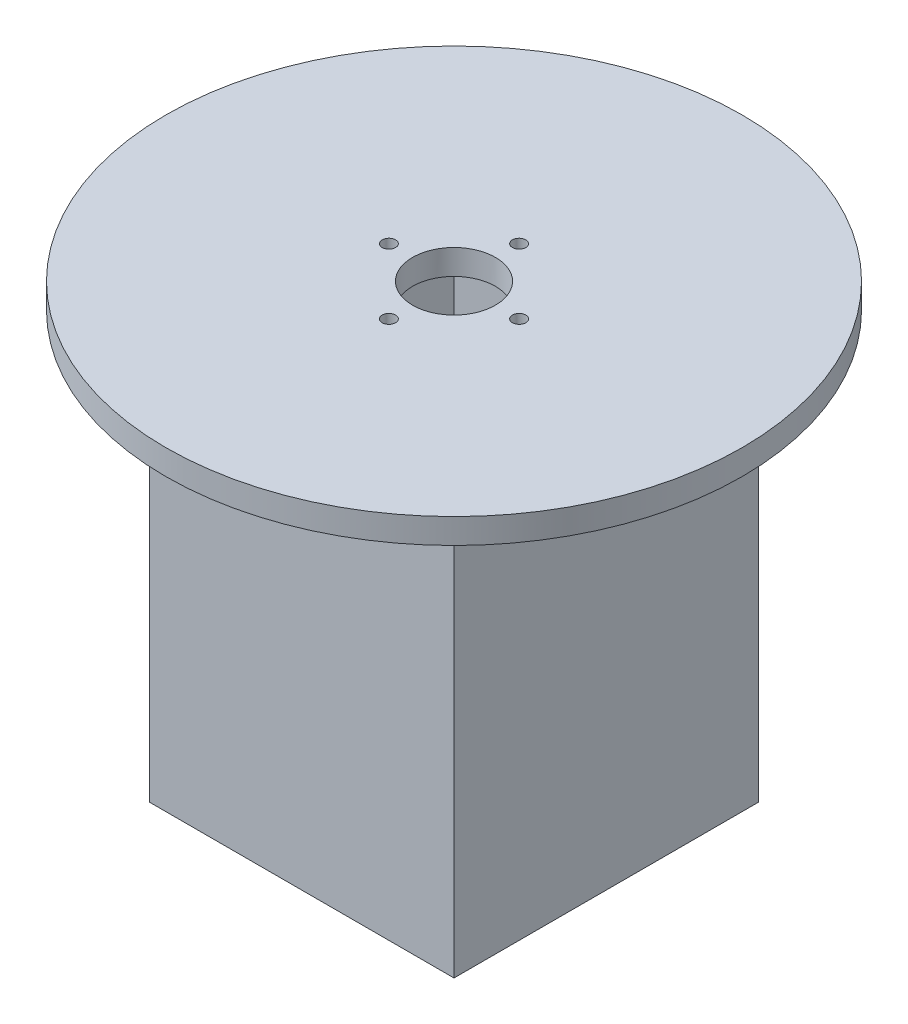
ISO-10303-21;
HEADER;
FILE_DESCRIPTION(('STEP AP214'),'2;1');
FILE_NAME('part.step','',(''),(''),'','','');
FILE_SCHEMA(('AUTOMOTIVE_DESIGN { 1 0 10303 214 1 1 1 1 }'));
ENDSEC;
DATA;
#1=APPLICATION_CONTEXT('core data for automotive mechanical design processes');
#2=APPLICATION_PROTOCOL_DEFINITION('international standard','automotive_design',2000,#1);
#3=PRODUCT_CONTEXT('',#1,'mechanical');
#4=PRODUCT('Part','Part','',(#3));
#5=PRODUCT_RELATED_PRODUCT_CATEGORY('part','',(#4));
#6=PRODUCT_DEFINITION_FORMATION('','',#4);
#7=PRODUCT_DEFINITION_CONTEXT('part definition',#1,'design');
#8=PRODUCT_DEFINITION('design','',#6,#7);
#9=PRODUCT_DEFINITION_SHAPE('','',#8);
#10=(LENGTH_UNIT() NAMED_UNIT(*) SI_UNIT(.MILLI.,.METRE.));
#11=(NAMED_UNIT(*) PLANE_ANGLE_UNIT() SI_UNIT($,.RADIAN.));
#12=(NAMED_UNIT(*) SI_UNIT($,.STERADIAN.) SOLID_ANGLE_UNIT());
#13=UNCERTAINTY_MEASURE_WITH_UNIT(LENGTH_MEASURE(1.E-05),#10,'distance_accuracy_value','');
#14=(GEOMETRIC_REPRESENTATION_CONTEXT(3) GLOBAL_UNCERTAINTY_ASSIGNED_CONTEXT((#13)) GLOBAL_UNIT_ASSIGNED_CONTEXT((#10,
#11,#12)) REPRESENTATION_CONTEXT('',''));
#15=CARTESIAN_POINT('',(0.,0.,0.));
#16=DIRECTION('',(0.,0.,1.));
#17=DIRECTION('',(1.,0.,0.));
#18=AXIS2_PLACEMENT_3D('',#15,#16,#17);
#19=CARTESIAN_POINT('',(0.,0.,-77.2));
#20=DIRECTION('',(-1.,0.,0.));
#21=DIRECTION('',(0.,0.,1.));
#22=AXIS2_PLACEMENT_3D('',#19,#20,#21);
#23=PLANE('',#22);
#24=DIRECTION('',(0.,-1.,0.));
#25=VECTOR('',#24,1.);
#26=CARTESIAN_POINT('',(0.,0.,0.));
#27=LINE('',#26,#25);
#28=CARTESIAN_POINT('',(0.,107.95,0.));
#29=VERTEX_POINT('',#28);
#30=CARTESIAN_POINT('',(0.,0.,0.));
#31=VERTEX_POINT('',#30);
#32=EDGE_CURVE('E175',#29,#31,#27,.T.);
#33=ORIENTED_EDGE('',*,*,#32,.F.);
#34=DIRECTION('',(0.,0.,-1.));
#35=VECTOR('',#34,1.);
#36=CARTESIAN_POINT('',(0.,107.95,-77.2));
#37=LINE('',#36,#35);
#38=CARTESIAN_POINT('',(0.,107.95,-77.2));
#39=VERTEX_POINT('',#38);
#40=EDGE_CURVE('E63',#29,#39,#37,.T.);
#41=ORIENTED_EDGE('',*,*,#40,.T.);
#42=DIRECTION('',(0.,-1.,0.));
#43=VECTOR('',#42,1.);
#44=CARTESIAN_POINT('',(0.,0.,-77.2));
#45=LINE('',#44,#43);
#46=CARTESIAN_POINT('',(0.,0.,-77.2));
#47=VERTEX_POINT('',#46);
#48=EDGE_CURVE('E114',#39,#47,#45,.T.);
#49=ORIENTED_EDGE('',*,*,#48,.T.);
#50=DIRECTION('',(0.,0.,1.));
#51=VECTOR('',#50,1.);
#52=CARTESIAN_POINT('',(0.,0.,-77.2));
#53=LINE('',#52,#51);
#54=EDGE_CURVE('E47',#47,#31,#53,.T.);
#55=ORIENTED_EDGE('',*,*,#54,.T.);
#56=EDGE_LOOP('',(#33,#41,#49,#55));
#57=FACE_BOUND('',#56,.T.);
#58=ADVANCED_FACE('F39',(#57),#23,.T.);
#59=CARTESIAN_POINT('',(77.2,0.,-77.2));
#60=DIRECTION('',(1.,0.,0.));
#61=DIRECTION('',(0.,0.,-1.));
#62=AXIS2_PLACEMENT_3D('',#59,#60,#61);
#63=PLANE('',#62);
#64=DIRECTION('',(0.,1.,0.));
#65=VECTOR('',#64,1.);
#66=CARTESIAN_POINT('',(77.2,0.,-77.2));
#67=LINE('',#66,#65);
#68=CARTESIAN_POINT('',(77.2,0.,-77.2));
#69=VERTEX_POINT('',#68);
#70=CARTESIAN_POINT('',(77.2,107.95,-77.2));
#71=VERTEX_POINT('',#70);
#72=EDGE_CURVE('E119',#69,#71,#67,.T.);
#73=ORIENTED_EDGE('',*,*,#72,.T.);
#74=DIRECTION('',(0.,0.,1.));
#75=VECTOR('',#74,1.);
#76=CARTESIAN_POINT('',(77.2,107.95,-77.2));
#77=LINE('',#76,#75);
#78=CARTESIAN_POINT('',(77.2,107.95,0.));
#79=VERTEX_POINT('',#78);
#80=EDGE_CURVE('E117',#71,#79,#77,.T.);
#81=ORIENTED_EDGE('',*,*,#80,.T.);
#82=DIRECTION('',(0.,1.,0.));
#83=VECTOR('',#82,1.);
#84=CARTESIAN_POINT('',(77.2,0.,0.));
#85=LINE('',#84,#83);
#86=CARTESIAN_POINT('',(77.2,0.,0.));
#87=VERTEX_POINT('',#86);
#88=EDGE_CURVE('E106',#87,#79,#85,.T.);
#89=ORIENTED_EDGE('',*,*,#88,.F.);
#90=DIRECTION('',(0.,0.,1.));
#91=VECTOR('',#90,1.);
#92=CARTESIAN_POINT('',(77.2,0.,-77.2));
#93=LINE('',#92,#91);
#94=EDGE_CURVE('E11',#69,#87,#93,.T.);
#95=ORIENTED_EDGE('',*,*,#94,.F.);
#96=EDGE_LOOP('',(#73,#81,#89,#95));
#97=FACE_BOUND('',#96,.T.);
#98=ADVANCED_FACE('F118',(#97),#63,.T.);
#99=CARTESIAN_POINT('',(0.,0.,-77.2));
#100=DIRECTION('',(0.,0.,-1.));
#101=DIRECTION('',(-1.,0.,0.));
#102=AXIS2_PLACEMENT_3D('',#99,#100,#101);
#103=PLANE('',#102);
#104=ORIENTED_EDGE('',*,*,#48,.F.);
#105=DIRECTION('',(1.,0.,0.));
#106=VECTOR('',#105,1.);
#107=CARTESIAN_POINT('',(0.,107.95,-77.2));
#108=LINE('',#107,#106);
#109=EDGE_CURVE('E55',#39,#71,#108,.T.);
#110=ORIENTED_EDGE('',*,*,#109,.T.);
#111=ORIENTED_EDGE('',*,*,#72,.F.);
#112=DIRECTION('',(1.,0.,0.));
#113=VECTOR('',#112,1.);
#114=CARTESIAN_POINT('',(0.,0.,-77.2));
#115=LINE('',#114,#113);
#116=EDGE_CURVE('E183',#47,#69,#115,.T.);
#117=ORIENTED_EDGE('',*,*,#116,.F.);
#118=EDGE_LOOP('',(#104,#110,#111,#117));
#119=FACE_BOUND('',#118,.T.);
#120=ADVANCED_FACE('F243',(#119),#103,.T.);
#121=CARTESIAN_POINT('',(0.,0.,0.));
#122=DIRECTION('',(0.,0.,-1.));
#123=DIRECTION('',(-1.,0.,0.));
#124=AXIS2_PLACEMENT_3D('',#121,#122,#123);
#125=PLANE('',#124);
#126=DIRECTION('',(1.,0.,0.));
#127=VECTOR('',#126,1.);
#128=CARTESIAN_POINT('',(0.,107.95,0.));
#129=LINE('',#128,#127);
#130=EDGE_CURVE('E110',#29,#79,#129,.T.);
#131=ORIENTED_EDGE('',*,*,#130,.F.);
#132=ORIENTED_EDGE('',*,*,#32,.T.);
#133=DIRECTION('',(1.,0.,0.));
#134=VECTOR('',#133,1.);
#135=CARTESIAN_POINT('',(0.,0.,0.));
#136=LINE('',#135,#134);
#137=EDGE_CURVE('E112',#31,#87,#136,.T.);
#138=ORIENTED_EDGE('',*,*,#137,.T.);
#139=ORIENTED_EDGE('',*,*,#88,.T.);
#140=EDGE_LOOP('',(#131,#132,#138,#139));
#141=FACE_BOUND('',#140,.T.);
#142=ADVANCED_FACE('F108',(#141),#125,.F.);
#143=CARTESIAN_POINT('',(0.,114.3,-77.2));
#144=DIRECTION('',(0.,1.,0.));
#145=DIRECTION('',(0.,0.,1.));
#146=AXIS2_PLACEMENT_3D('',#143,#144,#145);
#147=PLANE('',#146);
#148=CARTESIAN_POINT('',(38.6,114.3,-55.1));
#149=DIRECTION('',(0.,1.,0.));
#150=DIRECTION('',(0.,0.,1.));
#151=AXIS2_PLACEMENT_3D('',#148,#149,#150);
#152=CIRCLE('',#151,1.7);
#153=CARTESIAN_POINT('',(38.6,114.3,-53.4));
#154=VERTEX_POINT('',#153);
#155=EDGE_CURVE('E140',#154,#154,#152,.T.);
#156=ORIENTED_EDGE('',*,*,#155,.F.);
#157=EDGE_LOOP('',(#156));
#158=FACE_BOUND('',#157,.T.);
#159=CARTESIAN_POINT('',(55.1,114.3,-38.6));
#160=DIRECTION('',(0.,1.,0.));
#161=DIRECTION('',(0.,0.,1.));
#162=AXIS2_PLACEMENT_3D('',#159,#160,#161);
#163=CIRCLE('',#162,1.7);
#164=CARTESIAN_POINT('',(55.1,114.3,-36.9));
#165=VERTEX_POINT('',#164);
#166=EDGE_CURVE('E137',#165,#165,#163,.T.);
#167=ORIENTED_EDGE('',*,*,#166,.F.);
#168=EDGE_LOOP('',(#167));
#169=FACE_BOUND('',#168,.T.);
#170=CARTESIAN_POINT('',(38.6,114.3,-22.1));
#171=DIRECTION('',(0.,1.,0.));
#172=DIRECTION('',(0.,0.,1.));
#173=AXIS2_PLACEMENT_3D('',#170,#171,#172);
#174=CIRCLE('',#173,1.7);
#175=CARTESIAN_POINT('',(38.6,114.3,-20.4));
#176=VERTEX_POINT('',#175);
#177=EDGE_CURVE('E134',#176,#176,#174,.T.);
#178=ORIENTED_EDGE('',*,*,#177,.F.);
#179=EDGE_LOOP('',(#178));
#180=FACE_BOUND('',#179,.T.);
#181=CARTESIAN_POINT('',(22.1,114.3,-38.6));
#182=DIRECTION('',(0.,1.,0.));
#183=DIRECTION('',(0.,0.,1.));
#184=AXIS2_PLACEMENT_3D('',#181,#182,#183);
#185=CIRCLE('',#184,1.7);
#186=CARTESIAN_POINT('',(22.1,114.3,-36.9));
#187=VERTEX_POINT('',#186);
#188=EDGE_CURVE('E133',#187,#187,#185,.T.);
#189=ORIENTED_EDGE('',*,*,#188,.F.);
#190=EDGE_LOOP('',(#189));
#191=FACE_BOUND('',#190,.T.);
#192=CARTESIAN_POINT('',(38.6,114.3,-38.6));
#193=DIRECTION('',(0.,1.,0.));
#194=DIRECTION('',(0.,0.,1.));
#195=AXIS2_PLACEMENT_3D('',#192,#193,#194);
#196=CIRCLE('',#195,10.5);
#197=CARTESIAN_POINT('',(38.6,114.3,-28.1));
#198=VERTEX_POINT('',#197);
#199=EDGE_CURVE('E143',#198,#198,#196,.T.);
#200=ORIENTED_EDGE('',*,*,#199,.F.);
#201=EDGE_LOOP('',(#200));
#202=FACE_BOUND('',#201,.T.);
#203=CARTESIAN_POINT('',(38.6,114.3,-38.6));
#204=DIRECTION('',(0.,1.,0.));
#205=DIRECTION('',(0.,0.,1.));
#206=AXIS2_PLACEMENT_3D('',#203,#204,#205);
#207=CIRCLE('',#206,73.025);
#208=CARTESIAN_POINT('',(38.6,114.3,34.425));
#209=VERTEX_POINT('',#208);
#210=EDGE_CURVE('E127',#209,#209,#207,.T.);
#211=ORIENTED_EDGE('',*,*,#210,.T.);
#212=EDGE_LOOP('',(#211));
#213=FACE_BOUND('',#212,.T.);
#214=ADVANCED_FACE('F240',(#158,#169,#180,#191,#202,#213),#147,.T.);
#215=CARTESIAN_POINT('',(0.,0.,-77.2));
#216=DIRECTION('',(0.,-1.,0.));
#217=DIRECTION('',(0.,0.,-1.));
#218=AXIS2_PLACEMENT_3D('',#215,#216,#217);
#219=PLANE('',#218);
#220=DIRECTION('',(0.,0.,-1.));
#221=VECTOR('',#220,1.);
#222=CARTESIAN_POINT('',(3.31,0.,-3.31));
#223=LINE('',#222,#221);
#224=CARTESIAN_POINT('',(3.31,0.,-3.31));
#225=VERTEX_POINT('',#224);
#226=CARTESIAN_POINT('',(3.31000000000001,0.,-73.89));
#227=VERTEX_POINT('',#226);
#228=EDGE_CURVE('E163',#225,#227,#223,.T.);
#229=ORIENTED_EDGE('',*,*,#228,.F.);
#230=DIRECTION('',(-1.,0.,0.));
#231=VECTOR('',#230,1.);
#232=CARTESIAN_POINT('',(3.31,0.,-3.31));
#233=LINE('',#232,#231);
#234=CARTESIAN_POINT('',(73.89,0.,-3.31));
#235=VERTEX_POINT('',#234);
#236=EDGE_CURVE('E153',#235,#225,#233,.T.);
#237=ORIENTED_EDGE('',*,*,#236,.F.);
#238=DIRECTION('',(0.,0.,1.));
#239=VECTOR('',#238,1.);
#240=CARTESIAN_POINT('',(73.89,0.,-3.31));
#241=LINE('',#240,#239);
#242=CARTESIAN_POINT('',(73.89,0.,-73.89));
#243=VERTEX_POINT('',#242);
#244=EDGE_CURVE('E168',#243,#235,#241,.T.);
#245=ORIENTED_EDGE('',*,*,#244,.F.);
#246=DIRECTION('',(1.,0.,0.));
#247=VECTOR('',#246,1.);
#248=CARTESIAN_POINT('',(3.31000000000001,0.,-73.89));
#249=LINE('',#248,#247);
#250=EDGE_CURVE('E165',#227,#243,#249,.T.);
#251=ORIENTED_EDGE('',*,*,#250,.F.);
#252=EDGE_LOOP('',(#229,#237,#245,#251));
#253=FACE_BOUND('',#252,.T.);
#254=ORIENTED_EDGE('',*,*,#137,.F.);
#255=ORIENTED_EDGE('',*,*,#54,.F.);
#256=ORIENTED_EDGE('',*,*,#116,.T.);
#257=ORIENTED_EDGE('',*,*,#94,.T.);
#258=EDGE_LOOP('',(#254,#255,#256,#257));
#259=FACE_BOUND('',#258,.T.);
#260=ADVANCED_FACE('F237',(#253,#259),#219,.T.);
#261=CARTESIAN_POINT('',(3.31,107.95,-3.31));
#262=DIRECTION('',(-1.,0.,0.));
#263=DIRECTION('',(0.,0.,1.));
#264=AXIS2_PLACEMENT_3D('',#261,#262,#263);
#265=PLANE('',#264);
#266=ORIENTED_EDGE('',*,*,#228,.T.);
#267=DIRECTION('',(0.,-1.,0.));
#268=VECTOR('',#267,1.);
#269=CARTESIAN_POINT('',(3.31000000000001,107.95,-73.89));
#270=LINE('',#269,#268);
#271=CARTESIAN_POINT('',(3.31000000000001,107.95,-73.89));
#272=VERTEX_POINT('',#271);
#273=EDGE_CURVE('E162',#272,#227,#270,.T.);
#274=ORIENTED_EDGE('',*,*,#273,.F.);
#275=DIRECTION('',(0.,0.,-1.));
#276=VECTOR('',#275,1.);
#277=CARTESIAN_POINT('',(3.31,107.95,-3.31));
#278=LINE('',#277,#276);
#279=CARTESIAN_POINT('',(3.31,107.95,-3.31));
#280=VERTEX_POINT('',#279);
#281=EDGE_CURVE('E149',#280,#272,#278,.T.);
#282=ORIENTED_EDGE('',*,*,#281,.F.);
#283=DIRECTION('',(0.,-1.,0.));
#284=VECTOR('',#283,1.);
#285=CARTESIAN_POINT('',(3.31,107.95,-3.31));
#286=LINE('',#285,#284);
#287=EDGE_CURVE('E173',#280,#225,#286,.T.);
#288=ORIENTED_EDGE('',*,*,#287,.T.);
#289=EDGE_LOOP('',(#266,#274,#282,#288));
#290=FACE_BOUND('',#289,.T.);
#291=ADVANCED_FACE('F225',(#290),#265,.F.);
#292=CARTESIAN_POINT('',(3.31,107.95,-3.31));
#293=DIRECTION('',(0.,0.,1.));
#294=DIRECTION('',(1.,0.,0.));
#295=AXIS2_PLACEMENT_3D('',#292,#293,#294);
#296=PLANE('',#295);
#297=ORIENTED_EDGE('',*,*,#236,.T.);
#298=ORIENTED_EDGE('',*,*,#287,.F.);
#299=DIRECTION('',(-1.,0.,0.));
#300=VECTOR('',#299,1.);
#301=CARTESIAN_POINT('',(3.31,107.95,-3.31));
#302=LINE('',#301,#300);
#303=CARTESIAN_POINT('',(73.89,107.95,-3.31));
#304=VERTEX_POINT('',#303);
#305=EDGE_CURVE('E159',#304,#280,#302,.T.);
#306=ORIENTED_EDGE('',*,*,#305,.F.);
#307=DIRECTION('',(0.,-1.,0.));
#308=VECTOR('',#307,1.);
#309=CARTESIAN_POINT('',(73.89,107.95,-3.31));
#310=LINE('',#309,#308);
#311=EDGE_CURVE('E176',#304,#235,#310,.T.);
#312=ORIENTED_EDGE('',*,*,#311,.T.);
#313=EDGE_LOOP('',(#297,#298,#306,#312));
#314=FACE_BOUND('',#313,.T.);
#315=ADVANCED_FACE('F234',(#314),#296,.F.);
#316=CARTESIAN_POINT('',(73.89,107.95,-3.31));
#317=DIRECTION('',(1.,0.,0.));
#318=DIRECTION('',(0.,0.,-1.));
#319=AXIS2_PLACEMENT_3D('',#316,#317,#318);
#320=PLANE('',#319);
#321=ORIENTED_EDGE('',*,*,#244,.T.);
#322=ORIENTED_EDGE('',*,*,#311,.F.);
#323=DIRECTION('',(0.,0.,1.));
#324=VECTOR('',#323,1.);
#325=CARTESIAN_POINT('',(73.89,107.95,-3.31));
#326=LINE('',#325,#324);
#327=CARTESIAN_POINT('',(73.89,107.95,-73.89));
#328=VERTEX_POINT('',#327);
#329=EDGE_CURVE('E156',#328,#304,#326,.T.);
#330=ORIENTED_EDGE('',*,*,#329,.F.);
#331=DIRECTION('',(0.,-1.,0.));
#332=VECTOR('',#331,1.);
#333=CARTESIAN_POINT('',(73.89,107.95,-73.89));
#334=LINE('',#333,#332);
#335=EDGE_CURVE('E178',#328,#243,#334,.T.);
#336=ORIENTED_EDGE('',*,*,#335,.T.);
#337=EDGE_LOOP('',(#321,#322,#330,#336));
#338=FACE_BOUND('',#337,.T.);
#339=ADVANCED_FACE('F232',(#338),#320,.F.);
#340=CARTESIAN_POINT('',(3.31000000000001,107.95,-73.89));
#341=DIRECTION('',(0.,0.,-1.));
#342=DIRECTION('',(-1.,0.,0.));
#343=AXIS2_PLACEMENT_3D('',#340,#341,#342);
#344=PLANE('',#343);
#345=ORIENTED_EDGE('',*,*,#250,.T.);
#346=ORIENTED_EDGE('',*,*,#335,.F.);
#347=DIRECTION('',(1.,0.,0.));
#348=VECTOR('',#347,1.);
#349=CARTESIAN_POINT('',(3.31000000000001,107.95,-73.89));
#350=LINE('',#349,#348);
#351=EDGE_CURVE('E152',#272,#328,#350,.T.);
#352=ORIENTED_EDGE('',*,*,#351,.F.);
#353=ORIENTED_EDGE('',*,*,#273,.T.);
#354=EDGE_LOOP('',(#345,#346,#352,#353));
#355=FACE_BOUND('',#354,.T.);
#356=ADVANCED_FACE('F212',(#355),#344,.F.);
#357=CARTESIAN_POINT('',(0.,107.95,0.));
#358=DIRECTION('',(0.,-1.,0.));
#359=DIRECTION('',(0.,0.,-1.));
#360=AXIS2_PLACEMENT_3D('',#357,#358,#359);
#361=PLANE('',#360);
#362=CARTESIAN_POINT('',(38.6,107.95,-55.1));
#363=DIRECTION('',(0.,-1.,0.));
#364=DIRECTION('',(0.,0.,-1.));
#365=AXIS2_PLACEMENT_3D('',#362,#363,#364);
#366=CIRCLE('',#365,1.7);
#367=CARTESIAN_POINT('',(38.6,107.95,-56.8));
#368=VERTEX_POINT('',#367);
#369=EDGE_CURVE('E42',#368,#368,#366,.T.);
#370=ORIENTED_EDGE('',*,*,#369,.F.);
#371=EDGE_LOOP('',(#370));
#372=FACE_BOUND('',#371,.T.);
#373=CARTESIAN_POINT('',(55.1,107.95,-38.6));
#374=DIRECTION('',(0.,-1.,0.));
#375=DIRECTION('',(0.,0.,-1.));
#376=AXIS2_PLACEMENT_3D('',#373,#374,#375);
#377=CIRCLE('',#376,1.7);
#378=CARTESIAN_POINT('',(55.1,107.95,-40.3));
#379=VERTEX_POINT('',#378);
#380=EDGE_CURVE('E198',#379,#379,#377,.T.);
#381=ORIENTED_EDGE('',*,*,#380,.F.);
#382=EDGE_LOOP('',(#381));
#383=FACE_BOUND('',#382,.T.);
#384=CARTESIAN_POINT('',(38.6,107.95,-22.1));
#385=DIRECTION('',(0.,-1.,0.));
#386=DIRECTION('',(0.,0.,-1.));
#387=AXIS2_PLACEMENT_3D('',#384,#385,#386);
#388=CIRCLE('',#387,1.7);
#389=CARTESIAN_POINT('',(38.6,107.95,-23.8));
#390=VERTEX_POINT('',#389);
#391=EDGE_CURVE('E196',#390,#390,#388,.T.);
#392=ORIENTED_EDGE('',*,*,#391,.F.);
#393=EDGE_LOOP('',(#392));
#394=FACE_BOUND('',#393,.T.);
#395=CARTESIAN_POINT('',(22.1,107.95,-38.6));
#396=DIRECTION('',(0.,-1.,0.));
#397=DIRECTION('',(0.,0.,-1.));
#398=AXIS2_PLACEMENT_3D('',#395,#396,#397);
#399=CIRCLE('',#398,1.7);
#400=CARTESIAN_POINT('',(22.1,107.95,-40.3));
#401=VERTEX_POINT('',#400);
#402=EDGE_CURVE('E193',#401,#401,#399,.T.);
#403=ORIENTED_EDGE('',*,*,#402,.F.);
#404=EDGE_LOOP('',(#403));
#405=FACE_BOUND('',#404,.T.);
#406=CARTESIAN_POINT('',(38.6,107.95,-38.6));
#407=DIRECTION('',(0.,-1.,0.));
#408=DIRECTION('',(0.,0.,-1.));
#409=AXIS2_PLACEMENT_3D('',#406,#407,#408);
#410=CIRCLE('',#409,10.5);
#411=CARTESIAN_POINT('',(38.6,107.95,-49.1));
#412=VERTEX_POINT('',#411);
#413=EDGE_CURVE('E148',#412,#412,#410,.T.);
#414=ORIENTED_EDGE('',*,*,#413,.F.);
#415=EDGE_LOOP('',(#414));
#416=FACE_BOUND('',#415,.T.);
#417=ORIENTED_EDGE('',*,*,#281,.T.);
#418=ORIENTED_EDGE('',*,*,#351,.T.);
#419=ORIENTED_EDGE('',*,*,#329,.T.);
#420=ORIENTED_EDGE('',*,*,#305,.T.);
#421=EDGE_LOOP('',(#417,#418,#419,#420));
#422=FACE_BOUND('',#421,.T.);
#423=ADVANCED_FACE('F208',(#372,#383,#394,#405,#416,#422),#361,.T.);
#424=CARTESIAN_POINT('',(38.6,0.,-38.6));
#425=DIRECTION('',(0.,1.,0.));
#426=DIRECTION('',(0.,0.,1.));
#427=AXIS2_PLACEMENT_3D('',#424,#425,#426);
#428=CYLINDRICAL_SURFACE('',#427,10.5);
#429=ORIENTED_EDGE('',*,*,#413,.T.);
#430=EDGE_LOOP('',(#429));
#431=FACE_BOUND('',#430,.T.);
#432=ORIENTED_EDGE('',*,*,#199,.T.);
#433=EDGE_LOOP('',(#432));
#434=FACE_BOUND('',#433,.T.);
#435=ADVANCED_FACE('F211',(#431,#434),#428,.F.);
#436=CARTESIAN_POINT('',(22.1,0.,-38.6));
#437=DIRECTION('',(0.,1.,0.));
#438=DIRECTION('',(0.,0.,1.));
#439=AXIS2_PLACEMENT_3D('',#436,#437,#438);
#440=CYLINDRICAL_SURFACE('',#439,1.7);
#441=ORIENTED_EDGE('',*,*,#402,.T.);
#442=EDGE_LOOP('',(#441));
#443=FACE_BOUND('',#442,.T.);
#444=ORIENTED_EDGE('',*,*,#188,.T.);
#445=EDGE_LOOP('',(#444));
#446=FACE_BOUND('',#445,.T.);
#447=ADVANCED_FACE('F269',(#443,#446),#440,.F.);
#448=CARTESIAN_POINT('',(38.6,0.,-22.1));
#449=DIRECTION('',(0.,1.,0.));
#450=DIRECTION('',(0.,0.,1.));
#451=AXIS2_PLACEMENT_3D('',#448,#449,#450);
#452=CYLINDRICAL_SURFACE('',#451,1.7);
#453=ORIENTED_EDGE('',*,*,#391,.T.);
#454=EDGE_LOOP('',(#453));
#455=FACE_BOUND('',#454,.T.);
#456=ORIENTED_EDGE('',*,*,#177,.T.);
#457=EDGE_LOOP('',(#456));
#458=FACE_BOUND('',#457,.T.);
#459=ADVANCED_FACE('F274',(#455,#458),#452,.F.);
#460=CARTESIAN_POINT('',(55.1,0.,-38.6));
#461=DIRECTION('',(0.,1.,0.));
#462=DIRECTION('',(0.,0.,1.));
#463=AXIS2_PLACEMENT_3D('',#460,#461,#462);
#464=CYLINDRICAL_SURFACE('',#463,1.7);
#465=ORIENTED_EDGE('',*,*,#380,.T.);
#466=EDGE_LOOP('',(#465));
#467=FACE_BOUND('',#466,.T.);
#468=ORIENTED_EDGE('',*,*,#166,.T.);
#469=EDGE_LOOP('',(#468));
#470=FACE_BOUND('',#469,.T.);
#471=ADVANCED_FACE('F271',(#467,#470),#464,.F.);
#472=CARTESIAN_POINT('',(38.6,0.,-55.1));
#473=DIRECTION('',(0.,1.,0.));
#474=DIRECTION('',(0.,0.,1.));
#475=AXIS2_PLACEMENT_3D('',#472,#473,#474);
#476=CYLINDRICAL_SURFACE('',#475,1.7);
#477=ORIENTED_EDGE('',*,*,#369,.T.);
#478=EDGE_LOOP('',(#477));
#479=FACE_BOUND('',#478,.T.);
#480=ORIENTED_EDGE('',*,*,#155,.T.);
#481=EDGE_LOOP('',(#480));
#482=FACE_BOUND('',#481,.T.);
#483=ADVANCED_FACE('F205',(#479,#482),#476,.F.);
#484=CARTESIAN_POINT('',(38.6,107.95,-38.6));
#485=DIRECTION('',(0.,1.,0.));
#486=DIRECTION('',(0.,0.,1.));
#487=AXIS2_PLACEMENT_3D('',#484,#485,#486);
#488=CYLINDRICAL_SURFACE('',#487,73.025);
#489=CARTESIAN_POINT('',(38.6,107.95,-38.6));
#490=DIRECTION('',(0.,1.,0.));
#491=DIRECTION('',(0.,0.,1.));
#492=AXIS2_PLACEMENT_3D('',#489,#490,#491);
#493=CIRCLE('',#492,73.025);
#494=CARTESIAN_POINT('',(38.6,107.95,34.425));
#495=VERTEX_POINT('',#494);
#496=EDGE_CURVE('E124',#495,#495,#493,.T.);
#497=ORIENTED_EDGE('',*,*,#496,.T.);
#498=EDGE_LOOP('',(#497));
#499=FACE_BOUND('',#498,.T.);
#500=ORIENTED_EDGE('',*,*,#210,.F.);
#501=EDGE_LOOP('',(#500));
#502=FACE_BOUND('',#501,.T.);
#503=ADVANCED_FACE('F277',(#499,#502),#488,.T.);
#504=CARTESIAN_POINT('',(38.6,107.95,-38.6));
#505=DIRECTION('',(0.,1.,0.));
#506=DIRECTION('',(0.,0.,1.));
#507=AXIS2_PLACEMENT_3D('',#504,#505,#506);
#508=PLANE('',#507);
#509=ORIENTED_EDGE('',*,*,#109,.F.);
#510=ORIENTED_EDGE('',*,*,#40,.F.);
#511=ORIENTED_EDGE('',*,*,#130,.T.);
#512=ORIENTED_EDGE('',*,*,#80,.F.);
#513=EDGE_LOOP('',(#509,#510,#511,#512));
#514=FACE_BOUND('',#513,.T.);
#515=ORIENTED_EDGE('',*,*,#496,.F.);
#516=EDGE_LOOP('',(#515));
#517=FACE_BOUND('',#516,.T.);
#518=ADVANCED_FACE('F122',(#514,#517),#508,.F.);
#519=CLOSED_SHELL('',(#58,#98,#120,#142,#214,#260,#291,#315,#339,#356,#423,#435,#447,#459,#471,
#483,#503,#518));
#520=MANIFOLD_SOLID_BREP('B2',#519);
#521=ADVANCED_BREP_SHAPE_REPRESENTATION('',(#18,#520),#14);
#522=SHAPE_DEFINITION_REPRESENTATION(#9,#521);
ENDSEC;
END-ISO-10303-21;
